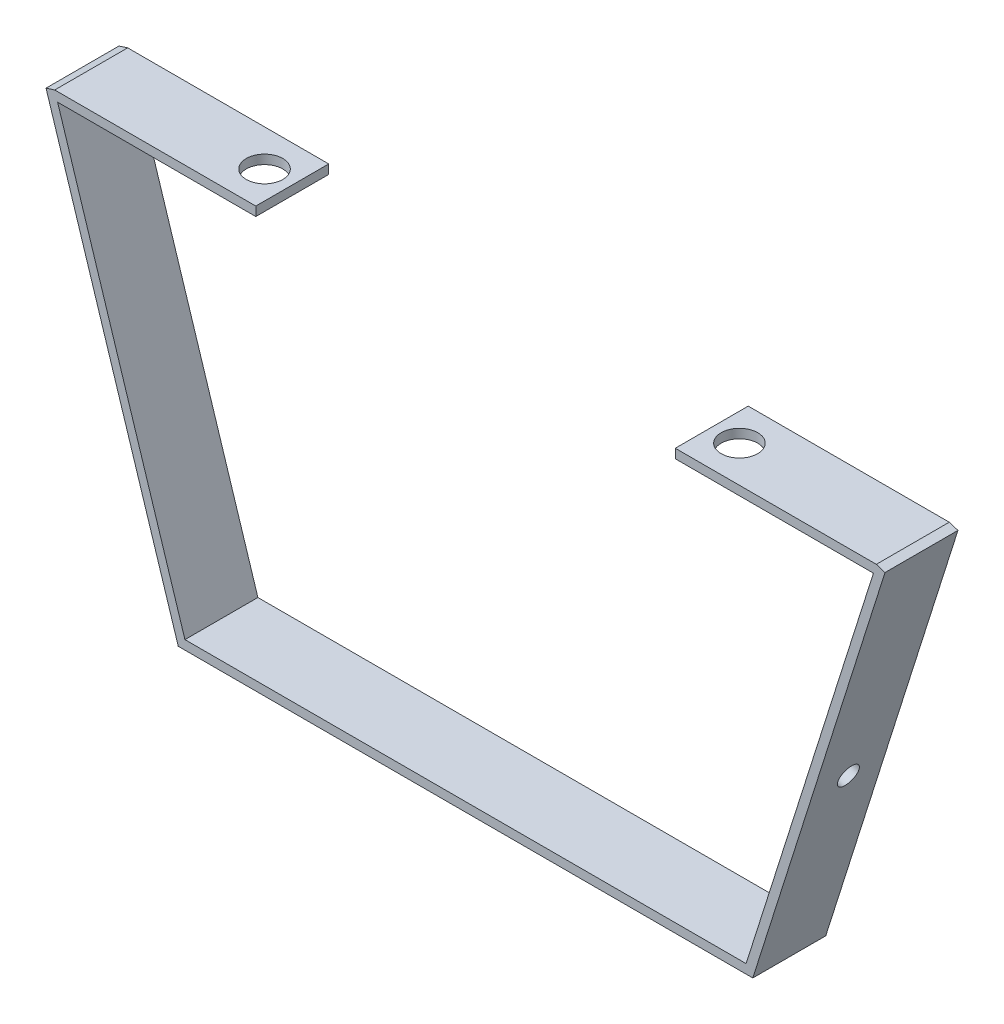
ISO-10303-21;
HEADER;
FILE_DESCRIPTION(('STEP AP214'),'2;1');
FILE_NAME('part.step','',(''),(''),'','','');
FILE_SCHEMA(('AUTOMOTIVE_DESIGN { 1 0 10303 214 1 1 1 1 }'));
ENDSEC;
DATA;
#1=APPLICATION_CONTEXT('core data for automotive mechanical design processes');
#2=APPLICATION_PROTOCOL_DEFINITION('international standard','automotive_design',2000,#1);
#3=PRODUCT_CONTEXT('',#1,'mechanical');
#4=PRODUCT('Part','Part','',(#3));
#5=PRODUCT_RELATED_PRODUCT_CATEGORY('part','',(#4));
#6=PRODUCT_DEFINITION_FORMATION('','',#4);
#7=PRODUCT_DEFINITION_CONTEXT('part definition',#1,'design');
#8=PRODUCT_DEFINITION('design','',#6,#7);
#9=PRODUCT_DEFINITION_SHAPE('','',#8);
#10=(LENGTH_UNIT() NAMED_UNIT(*) SI_UNIT(.MILLI.,.METRE.));
#11=(NAMED_UNIT(*) PLANE_ANGLE_UNIT() SI_UNIT($,.RADIAN.));
#12=(NAMED_UNIT(*) SI_UNIT($,.STERADIAN.) SOLID_ANGLE_UNIT());
#13=UNCERTAINTY_MEASURE_WITH_UNIT(LENGTH_MEASURE(1.E-05),#10,'distance_accuracy_value','');
#14=(GEOMETRIC_REPRESENTATION_CONTEXT(3) GLOBAL_UNCERTAINTY_ASSIGNED_CONTEXT((#13)) GLOBAL_UNIT_ASSIGNED_CONTEXT((#10,
#11,#12)) REPRESENTATION_CONTEXT('',''));
#15=CARTESIAN_POINT('',(0.,0.,0.));
#16=DIRECTION('',(0.,0.,1.));
#17=DIRECTION('',(1.,0.,0.));
#18=AXIS2_PLACEMENT_3D('',#15,#16,#17);
#19=CARTESIAN_POINT('',(-95.9147297448123,-24.4509063930494,25.4));
#20=DIRECTION('',(0.953281521756413,0.302083333333333,0.));
#21=DIRECTION('',(-0.302083333333333,0.953281521756413,0.));
#22=AXIS2_PLACEMENT_3D('',#19,#20,#21);
#23=PLANE('',#22);
#24=DIRECTION('',(0.302083333333333,-0.953281521756413,0.));
#25=VECTOR('',#24,1.);
#26=CARTESIAN_POINT('',(-95.9147297448123,-24.4509063930494,0.));
#27=LINE('',#26,#25);
#28=CARTESIAN_POINT('',(-141.952229744812,120.829197522628,0.));
#29=VERTEX_POINT('',#28);
#30=CARTESIAN_POINT('',(-95.9147297448123,-24.4509063930494,0.));
#31=VERTEX_POINT('',#30);
#32=EDGE_CURVE('E193',#29,#31,#27,.T.);
#33=ORIENTED_EDGE('',*,*,#32,.T.);
#34=DIRECTION('',(0.,0.,-1.));
#35=VECTOR('',#34,1.);
#36=CARTESIAN_POINT('',(-95.9147297448123,-24.4509063930494,25.4));
#37=LINE('',#36,#35);
#38=CARTESIAN_POINT('',(-95.9147297448123,-24.4509063930494,25.4));
#39=VERTEX_POINT('',#38);
#40=EDGE_CURVE('E11',#39,#31,#37,.T.);
#41=ORIENTED_EDGE('',*,*,#40,.F.);
#42=DIRECTION('',(0.302083333333333,-0.953281521756413,0.));
#43=VECTOR('',#42,1.);
#44=CARTESIAN_POINT('',(-95.9147297448123,-24.4509063930494,25.4));
#45=LINE('',#44,#43);
#46=CARTESIAN_POINT('',(-141.952229744812,120.829197522628,25.4));
#47=VERTEX_POINT('',#46);
#48=EDGE_CURVE('E199',#47,#39,#45,.T.);
#49=ORIENTED_EDGE('',*,*,#48,.F.);
#50=DIRECTION('',(0.,0.,-1.));
#51=VECTOR('',#50,1.);
#52=CARTESIAN_POINT('',(-141.952229744812,120.829197522628,25.4));
#53=LINE('',#52,#51);
#54=EDGE_CURVE('E216',#47,#29,#53,.T.);
#55=ORIENTED_EDGE('',*,*,#54,.T.);
#56=EDGE_LOOP('',(#33,#41,#49,#55));
#57=FACE_BOUND('',#56,.T.);
#58=ADVANCED_FACE('F36',(#57),#23,.F.);
#59=CARTESIAN_POINT('',(-95.9147297448123,-24.4509063930494,25.4));
#60=DIRECTION('',(0.,1.,0.));
#61=DIRECTION('',(-1.,0.,0.));
#62=AXIS2_PLACEMENT_3D('',#59,#60,#61);
#63=PLANE('',#62);
#64=DIRECTION('',(1.,0.,0.));
#65=VECTOR('',#64,1.);
#66=CARTESIAN_POINT('',(-95.9147297448123,-24.4509063930494,0.));
#67=LINE('',#66,#65);
#68=CARTESIAN_POINT('',(104.110270255188,-24.4509063930494,0.));
#69=VERTEX_POINT('',#68);
#70=EDGE_CURVE('E219',#31,#69,#67,.T.);
#71=ORIENTED_EDGE('',*,*,#70,.T.);
#72=DIRECTION('',(0.,0.,-1.));
#73=VECTOR('',#72,1.);
#74=CARTESIAN_POINT('',(104.110270255188,-24.4509063930494,25.4));
#75=LINE('',#74,#73);
#76=CARTESIAN_POINT('',(104.110270255188,-24.4509063930494,25.4));
#77=VERTEX_POINT('',#76);
#78=EDGE_CURVE('E44',#77,#69,#75,.T.);
#79=ORIENTED_EDGE('',*,*,#78,.F.);
#80=DIRECTION('',(1.,0.,0.));
#81=VECTOR('',#80,1.);
#82=CARTESIAN_POINT('',(-95.9147297448123,-24.4509063930494,25.4));
#83=LINE('',#82,#81);
#84=EDGE_CURVE('E201',#39,#77,#83,.T.);
#85=ORIENTED_EDGE('',*,*,#84,.F.);
#86=ORIENTED_EDGE('',*,*,#40,.T.);
#87=EDGE_LOOP('',(#71,#79,#85,#86));
#88=FACE_BOUND('',#87,.T.);
#89=ADVANCED_FACE('F272',(#88),#63,.F.);
#90=CARTESIAN_POINT('',(104.110270255188,-24.4509063930494,25.4));
#91=DIRECTION('',(-0.953281521756413,0.302083333333333,0.));
#92=DIRECTION('',(-0.302083333333333,-0.953281521756413,0.));
#93=AXIS2_PLACEMENT_3D('',#90,#91,#92);
#94=PLANE('',#93);
#95=CARTESIAN_POINT('',(124.695585575661,40.5099787309323,12.7));
#96=DIRECTION('',(0.953281521756413,-0.302083333333333,0.));
#97=DIRECTION('',(0.302083333333333,0.953281521756413,0.));
#98=AXIS2_PLACEMENT_3D('',#95,#96,#97);
#99=CIRCLE('',#98,3.675);
#100=CARTESIAN_POINT('',(125.805741825661,44.0132883233872,12.7));
#101=VERTEX_POINT('',#100);
#102=EDGE_CURVE('E419',#101,#101,#99,.T.);
#103=ORIENTED_EDGE('',*,*,#102,.F.);
#104=EDGE_LOOP('',(#103));
#105=FACE_BOUND('',#104,.T.);
#106=DIRECTION('',(0.302083333333333,0.953281521756413,0.));
#107=VECTOR('',#106,1.);
#108=CARTESIAN_POINT('',(104.110270255188,-24.4509063930494,0.));
#109=LINE('',#108,#107);
#110=CARTESIAN_POINT('',(150.147770255188,120.829197522628,0.));
#111=VERTEX_POINT('',#110);
#112=EDGE_CURVE('E221',#69,#111,#109,.T.);
#113=ORIENTED_EDGE('',*,*,#112,.T.);
#114=DIRECTION('',(0.,0.,-1.));
#115=VECTOR('',#114,1.);
#116=CARTESIAN_POINT('',(150.147770255188,120.829197522628,25.4));
#117=LINE('',#116,#115);
#118=CARTESIAN_POINT('',(150.147770255188,120.829197522628,25.4));
#119=VERTEX_POINT('',#118);
#120=EDGE_CURVE('E242',#119,#111,#117,.T.);
#121=ORIENTED_EDGE('',*,*,#120,.F.);
#122=DIRECTION('',(0.302083333333333,0.953281521756413,0.));
#123=VECTOR('',#122,1.);
#124=CARTESIAN_POINT('',(104.110270255188,-24.4509063930494,25.4));
#125=LINE('',#124,#123);
#126=EDGE_CURVE('E204',#77,#119,#125,.T.);
#127=ORIENTED_EDGE('',*,*,#126,.F.);
#128=ORIENTED_EDGE('',*,*,#78,.T.);
#129=EDGE_LOOP('',(#113,#121,#127,#128));
#130=FACE_BOUND('',#129,.T.);
#131=ADVANCED_FACE('F250',(#105,#130),#94,.F.);
#132=CARTESIAN_POINT('',(147.121101423611,121.788312105961,25.4));
#133=DIRECTION('',(-0.302083333333333,-0.953281521756413,0.));
#134=DIRECTION('',(0.953281521756413,-0.302083333333333,0.));
#135=AXIS2_PLACEMENT_3D('',#132,#133,#134);
#136=PLANE('',#135);
#137=DIRECTION('',(-0.953281521756413,0.302083333333333,0.));
#138=VECTOR('',#137,1.);
#139=CARTESIAN_POINT('',(147.121101423611,121.788312105961,0.));
#140=LINE('',#139,#138);
#141=CARTESIAN_POINT('',(147.121101423611,121.788312105961,0.));
#142=VERTEX_POINT('',#141);
#143=EDGE_CURVE('E223',#111,#142,#140,.T.);
#144=ORIENTED_EDGE('',*,*,#143,.T.);
#145=DIRECTION('',(0.,0.,-1.));
#146=VECTOR('',#145,1.);
#147=CARTESIAN_POINT('',(147.121101423611,121.788312105961,25.4));
#148=LINE('',#147,#146);
#149=CARTESIAN_POINT('',(147.121101423611,121.788312105961,25.4));
#150=VERTEX_POINT('',#149);
#151=EDGE_CURVE('E239',#150,#142,#148,.T.);
#152=ORIENTED_EDGE('',*,*,#151,.F.);
#153=DIRECTION('',(-0.953281521756413,0.302083333333333,0.));
#154=VECTOR('',#153,1.);
#155=CARTESIAN_POINT('',(147.121101423611,121.788312105961,25.4));
#156=LINE('',#155,#154);
#157=EDGE_CURVE('E206',#119,#150,#156,.T.);
#158=ORIENTED_EDGE('',*,*,#157,.F.);
#159=ORIENTED_EDGE('',*,*,#120,.T.);
#160=EDGE_LOOP('',(#144,#152,#158,#159));
#161=FACE_BOUND('',#160,.T.);
#162=ADVANCED_FACE('F261',(#161),#136,.F.);
#163=CARTESIAN_POINT('',(101.785788592537,-21.2759063930494,25.4));
#164=DIRECTION('',(0.953281521756413,-0.302083333333333,0.));
#165=DIRECTION('',(0.302083333333333,0.953281521756413,0.));
#166=AXIS2_PLACEMENT_3D('',#163,#164,#165);
#167=PLANE('',#166);
#168=CARTESIAN_POINT('',(121.668916744084,41.4690933142657,12.7));
#169=DIRECTION('',(0.953281521756413,-0.302083333333333,0.));
#170=DIRECTION('',(0.302083333333333,0.953281521756413,0.));
#171=AXIS2_PLACEMENT_3D('',#168,#169,#170);
#172=CIRCLE('',#171,3.675);
#173=CARTESIAN_POINT('',(122.779072994084,44.9724029067205,12.7));
#174=VERTEX_POINT('',#173);
#175=EDGE_CURVE('E416',#174,#174,#172,.T.);
#176=ORIENTED_EDGE('',*,*,#175,.T.);
#177=EDGE_LOOP('',(#176));
#178=FACE_BOUND('',#177,.T.);
#179=DIRECTION('',(-0.302083333333333,-0.953281521756413,0.));
#180=VECTOR('',#179,1.);
#181=CARTESIAN_POINT('',(101.785788592537,-21.2759063930494,25.4));
#182=LINE('',#181,#180);
#183=CARTESIAN_POINT('',(146.114982495001,118.613312105961,25.4));
#184=VERTEX_POINT('',#183);
#185=CARTESIAN_POINT('',(101.785788592537,-21.2759063930494,25.4));
#186=VERTEX_POINT('',#185);
#187=EDGE_CURVE('E208',#184,#186,#182,.T.);
#188=ORIENTED_EDGE('',*,*,#187,.F.);
#189=DIRECTION('',(0.,0.,-1.));
#190=VECTOR('',#189,1.);
#191=CARTESIAN_POINT('',(146.114982495001,118.613312105961,25.4));
#192=LINE('',#191,#190);
#193=CARTESIAN_POINT('',(146.114982495001,118.613312105961,0.));
#194=VERTEX_POINT('',#193);
#195=EDGE_CURVE('E194',#184,#194,#192,.T.);
#196=ORIENTED_EDGE('',*,*,#195,.T.);
#197=DIRECTION('',(-0.302083333333333,-0.953281521756413,0.));
#198=VECTOR('',#197,1.);
#199=CARTESIAN_POINT('',(101.785788592537,-21.2759063930494,0.));
#200=LINE('',#199,#198);
#201=CARTESIAN_POINT('',(101.785788592537,-21.2759063930494,0.));
#202=VERTEX_POINT('',#201);
#203=EDGE_CURVE('E225',#194,#202,#200,.T.);
#204=ORIENTED_EDGE('',*,*,#203,.T.);
#205=DIRECTION('',(0.,0.,-1.));
#206=VECTOR('',#205,1.);
#207=CARTESIAN_POINT('',(101.785788592537,-21.2759063930494,25.4));
#208=LINE('',#207,#206);
#209=EDGE_CURVE('E236',#186,#202,#208,.T.);
#210=ORIENTED_EDGE('',*,*,#209,.F.);
#211=EDGE_LOOP('',(#188,#196,#204,#210));
#212=FACE_BOUND('',#211,.T.);
#213=ADVANCED_FACE('F300',(#178,#212),#167,.F.);
#214=CARTESIAN_POINT('',(-93.5902480821614,-21.2759063930494,25.4));
#215=DIRECTION('',(0.,-1.,0.));
#216=DIRECTION('',(0.,0.,-1.));
#217=AXIS2_PLACEMENT_3D('',#214,#215,#216);
#218=PLANE('',#217);
#219=DIRECTION('',(-1.,0.,0.));
#220=VECTOR('',#219,1.);
#221=CARTESIAN_POINT('',(-93.5902480821614,-21.2759063930494,0.));
#222=LINE('',#221,#220);
#223=CARTESIAN_POINT('',(-93.5902480821614,-21.2759063930494,0.));
#224=VERTEX_POINT('',#223);
#225=EDGE_CURVE('E227',#202,#224,#222,.T.);
#226=ORIENTED_EDGE('',*,*,#225,.T.);
#227=DIRECTION('',(0.,0.,-1.));
#228=VECTOR('',#227,1.);
#229=CARTESIAN_POINT('',(-93.5902480821614,-21.2759063930494,25.4));
#230=LINE('',#229,#228);
#231=CARTESIAN_POINT('',(-93.5902480821614,-21.2759063930494,25.4));
#232=VERTEX_POINT('',#231);
#233=EDGE_CURVE('E234',#232,#224,#230,.T.);
#234=ORIENTED_EDGE('',*,*,#233,.F.);
#235=DIRECTION('',(-1.,0.,0.));
#236=VECTOR('',#235,1.);
#237=CARTESIAN_POINT('',(-93.5902480821614,-21.2759063930494,25.4));
#238=LINE('',#237,#236);
#239=EDGE_CURVE('E210',#186,#232,#238,.T.);
#240=ORIENTED_EDGE('',*,*,#239,.F.);
#241=ORIENTED_EDGE('',*,*,#209,.T.);
#242=EDGE_LOOP('',(#226,#234,#240,#241));
#243=FACE_BOUND('',#242,.T.);
#244=ADVANCED_FACE('F285',(#243),#218,.F.);
#245=CARTESIAN_POINT('',(-93.5902480821614,-21.2759063930494,25.4));
#246=DIRECTION('',(-0.953281521756413,-0.302083333333333,0.));
#247=DIRECTION('',(0.302083333333333,-0.953281521756413,0.));
#248=AXIS2_PLACEMENT_3D('',#245,#246,#247);
#249=PLANE('',#248);
#250=DIRECTION('',(-0.302083333333333,0.953281521756413,0.));
#251=VECTOR('',#250,1.);
#252=CARTESIAN_POINT('',(-93.5902480821614,-21.2759063930494,0.));
#253=LINE('',#252,#251);
#254=CARTESIAN_POINT('',(-137.919441984626,118.613312105961,0.));
#255=VERTEX_POINT('',#254);
#256=EDGE_CURVE('E56',#224,#255,#253,.T.);
#257=ORIENTED_EDGE('',*,*,#256,.T.);
#258=DIRECTION('',(0.,0.,-1.));
#259=VECTOR('',#258,1.);
#260=CARTESIAN_POINT('',(-137.919441984626,118.613312105961,25.4));
#261=LINE('',#260,#259);
#262=CARTESIAN_POINT('',(-137.919441984626,118.613312105961,25.4));
#263=VERTEX_POINT('',#262);
#264=EDGE_CURVE('E51',#263,#255,#261,.T.);
#265=ORIENTED_EDGE('',*,*,#264,.F.);
#266=DIRECTION('',(-0.302083333333333,0.953281521756413,0.));
#267=VECTOR('',#266,1.);
#268=CARTESIAN_POINT('',(-93.5902480821614,-21.2759063930494,25.4));
#269=LINE('',#268,#267);
#270=EDGE_CURVE('E212',#232,#263,#269,.T.);
#271=ORIENTED_EDGE('',*,*,#270,.F.);
#272=ORIENTED_EDGE('',*,*,#233,.T.);
#273=EDGE_LOOP('',(#257,#265,#271,#272));
#274=FACE_BOUND('',#273,.T.);
#275=ADVANCED_FACE('F278',(#274),#249,.F.);
#276=CARTESIAN_POINT('',(-141.952229744812,120.829197522628,25.4));
#277=DIRECTION('',(0.302083333333341,-0.95328152175641,0.));
#278=DIRECTION('',(0.95328152175641,0.302083333333341,0.));
#279=AXIS2_PLACEMENT_3D('',#276,#277,#278);
#280=PLANE('',#279);
#281=DIRECTION('',(-0.95328152175641,-0.302083333333341,0.));
#282=VECTOR('',#281,1.);
#283=CARTESIAN_POINT('',(-141.952229744812,120.829197522628,0.));
#284=LINE('',#283,#282);
#285=CARTESIAN_POINT('',(-138.925560913236,121.788312105961,0.));
#286=VERTEX_POINT('',#285);
#287=EDGE_CURVE('E202',#286,#29,#284,.T.);
#288=ORIENTED_EDGE('',*,*,#287,.T.);
#289=ORIENTED_EDGE('',*,*,#54,.F.);
#290=DIRECTION('',(-0.95328152175641,-0.302083333333341,0.));
#291=VECTOR('',#290,1.);
#292=CARTESIAN_POINT('',(-141.952229744812,120.829197522628,25.4));
#293=LINE('',#292,#291);
#294=CARTESIAN_POINT('',(-138.925560913236,121.788312105961,25.4));
#295=VERTEX_POINT('',#294);
#296=EDGE_CURVE('E214',#295,#47,#293,.T.);
#297=ORIENTED_EDGE('',*,*,#296,.F.);
#298=DIRECTION('',(0.,0.,-1.));
#299=VECTOR('',#298,1.);
#300=CARTESIAN_POINT('',(-138.925560913236,121.788312105961,25.4));
#301=LINE('',#300,#299);
#302=EDGE_CURVE('E155',#295,#286,#301,.T.);
#303=ORIENTED_EDGE('',*,*,#302,.T.);
#304=EDGE_LOOP('',(#288,#289,#297,#303));
#305=FACE_BOUND('',#304,.T.);
#306=ADVANCED_FACE('F276',(#305),#280,.F.);
#307=CARTESIAN_POINT('',(0.,0.,25.4));
#308=DIRECTION('',(0.,0.,-1.));
#309=DIRECTION('',(-1.,0.,0.));
#310=AXIS2_PLACEMENT_3D('',#307,#308,#309);
#311=PLANE('',#310);
#312=ORIENTED_EDGE('',*,*,#48,.T.);
#313=ORIENTED_EDGE('',*,*,#84,.T.);
#314=ORIENTED_EDGE('',*,*,#126,.T.);
#315=ORIENTED_EDGE('',*,*,#157,.T.);
#316=DIRECTION('',(-1.,0.,0.));
#317=VECTOR('',#316,1.);
#318=CARTESIAN_POINT('',(0.,121.788312105961,25.4));
#319=LINE('',#318,#317);
#320=CARTESIAN_POINT('',(77.1211014236111,121.788312105961,25.4));
#321=VERTEX_POINT('',#320);
#322=EDGE_CURVE('E178',#150,#321,#319,.T.);
#323=ORIENTED_EDGE('',*,*,#322,.T.);
#324=DIRECTION('',(0.,-1.,0.));
#325=VECTOR('',#324,1.);
#326=CARTESIAN_POINT('',(77.1211014236111,0.,25.4));
#327=LINE('',#326,#325);
#328=CARTESIAN_POINT('',(77.1211014236111,118.613312105961,25.4));
#329=VERTEX_POINT('',#328);
#330=EDGE_CURVE('E176',#321,#329,#327,.T.);
#331=ORIENTED_EDGE('',*,*,#330,.T.);
#332=DIRECTION('',(-1.,0.,0.));
#333=VECTOR('',#332,1.);
#334=CARTESIAN_POINT('',(0.,118.613312105961,25.4));
#335=LINE('',#334,#333);
#336=EDGE_CURVE('E181',#184,#329,#335,.T.);
#337=ORIENTED_EDGE('',*,*,#336,.F.);
#338=ORIENTED_EDGE('',*,*,#187,.T.);
#339=ORIENTED_EDGE('',*,*,#239,.T.);
#340=ORIENTED_EDGE('',*,*,#270,.T.);
#341=DIRECTION('',(-1.,0.,0.));
#342=VECTOR('',#341,1.);
#343=CARTESIAN_POINT('',(0.,118.613312105961,25.4));
#344=LINE('',#343,#342);
#345=CARTESIAN_POINT('',(-68.9255609132356,118.613312105961,25.4));
#346=VERTEX_POINT('',#345);
#347=EDGE_CURVE('E148',#346,#263,#344,.T.);
#348=ORIENTED_EDGE('',*,*,#347,.F.);
#349=DIRECTION('',(0.,-1.,0.));
#350=VECTOR('',#349,1.);
#351=CARTESIAN_POINT('',(-68.9255609132356,0.,25.4));
#352=LINE('',#351,#350);
#353=CARTESIAN_POINT('',(-68.9255609132356,121.788312105961,25.4));
#354=VERTEX_POINT('',#353);
#355=EDGE_CURVE('E141',#354,#346,#352,.T.);
#356=ORIENTED_EDGE('',*,*,#355,.F.);
#357=DIRECTION('',(-1.,0.,0.));
#358=VECTOR('',#357,1.);
#359=CARTESIAN_POINT('',(0.,121.788312105961,25.4));
#360=LINE('',#359,#358);
#361=EDGE_CURVE('E152',#354,#295,#360,.T.);
#362=ORIENTED_EDGE('',*,*,#361,.T.);
#363=ORIENTED_EDGE('',*,*,#296,.T.);
#364=EDGE_LOOP('',(#312,#313,#314,#315,#323,#331,#337,#338,#339,#340,#348,#356,#362,#363));
#365=FACE_BOUND('',#364,.T.);
#366=ADVANCED_FACE('F161',(#365),#311,.F.);
#367=CARTESIAN_POINT('',(0.,0.,0.));
#368=DIRECTION('',(0.,0.,-1.));
#369=DIRECTION('',(-1.,0.,0.));
#370=AXIS2_PLACEMENT_3D('',#367,#368,#369);
#371=PLANE('',#370);
#372=ORIENTED_EDGE('',*,*,#32,.F.);
#373=ORIENTED_EDGE('',*,*,#287,.F.);
#374=DIRECTION('',(-1.,0.,0.));
#375=VECTOR('',#374,1.);
#376=CARTESIAN_POINT('',(0.,121.788312105961,0.));
#377=LINE('',#376,#375);
#378=CARTESIAN_POINT('',(-68.9255609132356,121.788312105961,0.));
#379=VERTEX_POINT('',#378);
#380=EDGE_CURVE('E167',#379,#286,#377,.T.);
#381=ORIENTED_EDGE('',*,*,#380,.F.);
#382=DIRECTION('',(0.,-1.,0.));
#383=VECTOR('',#382,1.);
#384=CARTESIAN_POINT('',(-68.9255609132356,0.,0.));
#385=LINE('',#384,#383);
#386=CARTESIAN_POINT('',(-68.9255609132356,118.613312105961,0.));
#387=VERTEX_POINT('',#386);
#388=EDGE_CURVE('E143',#379,#387,#385,.T.);
#389=ORIENTED_EDGE('',*,*,#388,.T.);
#390=DIRECTION('',(-1.,0.,0.));
#391=VECTOR('',#390,1.);
#392=CARTESIAN_POINT('',(0.,118.613312105961,0.));
#393=LINE('',#392,#391);
#394=EDGE_CURVE('E157',#387,#255,#393,.T.);
#395=ORIENTED_EDGE('',*,*,#394,.T.);
#396=ORIENTED_EDGE('',*,*,#256,.F.);
#397=ORIENTED_EDGE('',*,*,#225,.F.);
#398=ORIENTED_EDGE('',*,*,#203,.F.);
#399=DIRECTION('',(-1.,0.,0.));
#400=VECTOR('',#399,1.);
#401=CARTESIAN_POINT('',(0.,118.613312105961,0.));
#402=LINE('',#401,#400);
#403=CARTESIAN_POINT('',(77.1211014236111,118.613312105961,0.));
#404=VERTEX_POINT('',#403);
#405=EDGE_CURVE('E179',#194,#404,#402,.T.);
#406=ORIENTED_EDGE('',*,*,#405,.T.);
#407=DIRECTION('',(0.,-1.,0.));
#408=VECTOR('',#407,1.);
#409=CARTESIAN_POINT('',(77.1211014236111,0.,0.));
#410=LINE('',#409,#408);
#411=CARTESIAN_POINT('',(77.1211014236111,121.788312105961,0.));
#412=VERTEX_POINT('',#411);
#413=EDGE_CURVE('E174',#412,#404,#410,.T.);
#414=ORIENTED_EDGE('',*,*,#413,.F.);
#415=DIRECTION('',(-1.,0.,0.));
#416=VECTOR('',#415,1.);
#417=CARTESIAN_POINT('',(0.,121.788312105961,0.));
#418=LINE('',#417,#416);
#419=EDGE_CURVE('E187',#142,#412,#418,.T.);
#420=ORIENTED_EDGE('',*,*,#419,.F.);
#421=ORIENTED_EDGE('',*,*,#143,.F.);
#422=ORIENTED_EDGE('',*,*,#112,.F.);
#423=ORIENTED_EDGE('',*,*,#70,.F.);
#424=EDGE_LOOP('',(#372,#373,#381,#389,#395,#396,#397,#398,#406,#414,#420,#421,#422,#423));
#425=FACE_BOUND('',#424,.T.);
#426=ADVANCED_FACE('F256',(#425),#371,.T.);
#427=CARTESIAN_POINT('',(77.1211014236111,0.,25.4));
#428=DIRECTION('',(1.,0.,0.));
#429=DIRECTION('',(0.,0.,-1.));
#430=AXIS2_PLACEMENT_3D('',#427,#428,#429);
#431=PLANE('',#430);
#432=ORIENTED_EDGE('',*,*,#413,.T.);
#433=DIRECTION('',(0.,0.,-1.));
#434=VECTOR('',#433,1.);
#435=CARTESIAN_POINT('',(77.1211014236111,118.613312105961,25.4));
#436=LINE('',#435,#434);
#437=EDGE_CURVE('E191',#329,#404,#436,.T.);
#438=ORIENTED_EDGE('',*,*,#437,.F.);
#439=ORIENTED_EDGE('',*,*,#330,.F.);
#440=DIRECTION('',(0.,0.,-1.));
#441=VECTOR('',#440,1.);
#442=CARTESIAN_POINT('',(77.1211014236111,121.788312105961,25.4));
#443=LINE('',#442,#441);
#444=EDGE_CURVE('E184',#321,#412,#443,.T.);
#445=ORIENTED_EDGE('',*,*,#444,.T.);
#446=EDGE_LOOP('',(#432,#438,#439,#445));
#447=FACE_BOUND('',#446,.T.);
#448=ADVANCED_FACE('F333',(#447),#431,.F.);
#449=CARTESIAN_POINT('',(0.,118.613312105961,25.4));
#450=DIRECTION('',(0.,-1.,0.));
#451=DIRECTION('',(0.,0.,-1.));
#452=AXIS2_PLACEMENT_3D('',#449,#450,#451);
#453=PLANE('',#452);
#454=CARTESIAN_POINT('',(86.7711014236111,118.613312105961,12.7));
#455=DIRECTION('',(0.,-1.,0.));
#456=DIRECTION('',(0.,0.,-1.));
#457=AXIS2_PLACEMENT_3D('',#454,#455,#456);
#458=CIRCLE('',#457,6.35);
#459=CARTESIAN_POINT('',(86.7711014236111,118.613312105961,6.35));
#460=VERTEX_POINT('',#459);
#461=EDGE_CURVE('E169',#460,#460,#458,.T.);
#462=ORIENTED_EDGE('',*,*,#461,.F.);
#463=EDGE_LOOP('',(#462));
#464=FACE_BOUND('',#463,.T.);
#465=ORIENTED_EDGE('',*,*,#405,.F.);
#466=ORIENTED_EDGE('',*,*,#195,.F.);
#467=ORIENTED_EDGE('',*,*,#336,.T.);
#468=ORIENTED_EDGE('',*,*,#437,.T.);
#469=EDGE_LOOP('',(#465,#466,#467,#468));
#470=FACE_BOUND('',#469,.T.);
#471=ADVANCED_FACE('F330',(#464,#470),#453,.T.);
#472=CARTESIAN_POINT('',(0.,121.788312105961,25.4));
#473=DIRECTION('',(0.,-1.,0.));
#474=DIRECTION('',(1.,0.,0.));
#475=AXIS2_PLACEMENT_3D('',#472,#473,#474);
#476=PLANE('',#475);
#477=CARTESIAN_POINT('',(86.7711014236111,121.788312105961,12.7));
#478=DIRECTION('',(0.,1.,0.));
#479=DIRECTION('',(-1.,0.,0.));
#480=AXIS2_PLACEMENT_3D('',#477,#478,#479);
#481=CIRCLE('',#480,6.35);
#482=CARTESIAN_POINT('',(80.4211014236111,121.788312105961,12.7));
#483=VERTEX_POINT('',#482);
#484=EDGE_CURVE('E424',#483,#483,#481,.T.);
#485=ORIENTED_EDGE('',*,*,#484,.F.);
#486=EDGE_LOOP('',(#485));
#487=FACE_BOUND('',#486,.T.);
#488=ORIENTED_EDGE('',*,*,#419,.T.);
#489=ORIENTED_EDGE('',*,*,#444,.F.);
#490=ORIENTED_EDGE('',*,*,#322,.F.);
#491=ORIENTED_EDGE('',*,*,#151,.T.);
#492=EDGE_LOOP('',(#488,#489,#490,#491));
#493=FACE_BOUND('',#492,.T.);
#494=ADVANCED_FACE('F265',(#487,#493),#476,.F.);
#495=CARTESIAN_POINT('',(0.,121.788312105961,25.4));
#496=DIRECTION('',(0.,-1.,0.));
#497=DIRECTION('',(1.,0.,0.));
#498=AXIS2_PLACEMENT_3D('',#495,#496,#497);
#499=PLANE('',#498);
#500=CARTESIAN_POINT('',(-78.5755609132356,121.788312105961,12.7));
#501=DIRECTION('',(0.,1.,0.));
#502=DIRECTION('',(-1.,0.,0.));
#503=AXIS2_PLACEMENT_3D('',#500,#501,#502);
#504=CIRCLE('',#503,6.35);
#505=CARTESIAN_POINT('',(-84.9255609132356,121.788312105961,12.7));
#506=VERTEX_POINT('',#505);
#507=EDGE_CURVE('E421',#506,#506,#504,.T.);
#508=ORIENTED_EDGE('',*,*,#507,.F.);
#509=EDGE_LOOP('',(#508));
#510=FACE_BOUND('',#509,.T.);
#511=ORIENTED_EDGE('',*,*,#380,.T.);
#512=ORIENTED_EDGE('',*,*,#302,.F.);
#513=ORIENTED_EDGE('',*,*,#361,.F.);
#514=DIRECTION('',(0.,0.,-1.));
#515=VECTOR('',#514,1.);
#516=CARTESIAN_POINT('',(-68.9255609132356,121.788312105961,25.4));
#517=LINE('',#516,#515);
#518=EDGE_CURVE('E137',#354,#379,#517,.T.);
#519=ORIENTED_EDGE('',*,*,#518,.T.);
#520=EDGE_LOOP('',(#511,#512,#513,#519));
#521=FACE_BOUND('',#520,.T.);
#522=ADVANCED_FACE('F153',(#510,#521),#499,.F.);
#523=CARTESIAN_POINT('',(0.,118.613312105961,25.4));
#524=DIRECTION('',(0.,-1.,0.));
#525=DIRECTION('',(0.,0.,-1.));
#526=AXIS2_PLACEMENT_3D('',#523,#524,#525);
#527=PLANE('',#526);
#528=CARTESIAN_POINT('',(-78.5755609132356,118.613312105961,12.7));
#529=DIRECTION('',(0.,-1.,0.));
#530=DIRECTION('',(0.,0.,-1.));
#531=AXIS2_PLACEMENT_3D('',#528,#529,#530);
#532=CIRCLE('',#531,6.35);
#533=CARTESIAN_POINT('',(-78.5755609132356,118.613312105961,6.35));
#534=VERTEX_POINT('',#533);
#535=EDGE_CURVE('E39',#534,#534,#532,.T.);
#536=ORIENTED_EDGE('',*,*,#535,.F.);
#537=EDGE_LOOP('',(#536));
#538=FACE_BOUND('',#537,.T.);
#539=ORIENTED_EDGE('',*,*,#394,.F.);
#540=DIRECTION('',(0.,0.,-1.));
#541=VECTOR('',#540,1.);
#542=CARTESIAN_POINT('',(-68.9255609132356,118.613312105961,25.4));
#543=LINE('',#542,#541);
#544=EDGE_CURVE('E147',#346,#387,#543,.T.);
#545=ORIENTED_EDGE('',*,*,#544,.F.);
#546=ORIENTED_EDGE('',*,*,#347,.T.);
#547=ORIENTED_EDGE('',*,*,#264,.T.);
#548=EDGE_LOOP('',(#539,#545,#546,#547));
#549=FACE_BOUND('',#548,.T.);
#550=ADVANCED_FACE('F314',(#538,#549),#527,.T.);
#551=CARTESIAN_POINT('',(-68.9255609132356,0.,25.4));
#552=DIRECTION('',(1.,0.,0.));
#553=DIRECTION('',(0.,0.,-1.));
#554=AXIS2_PLACEMENT_3D('',#551,#552,#553);
#555=PLANE('',#554);
#556=ORIENTED_EDGE('',*,*,#388,.F.);
#557=ORIENTED_EDGE('',*,*,#518,.F.);
#558=ORIENTED_EDGE('',*,*,#355,.T.);
#559=ORIENTED_EDGE('',*,*,#544,.T.);
#560=EDGE_LOOP('',(#556,#557,#558,#559));
#561=FACE_BOUND('',#560,.T.);
#562=ADVANCED_FACE('F139',(#561),#555,.T.);
#563=CARTESIAN_POINT('',(-78.5755609132356,111.788312105961,12.7));
#564=DIRECTION('',(0.,1.,0.));
#565=DIRECTION('',(-1.,0.,0.));
#566=AXIS2_PLACEMENT_3D('',#563,#564,#565);
#567=CYLINDRICAL_SURFACE('',#566,6.35);
#568=ORIENTED_EDGE('',*,*,#535,.T.);
#569=EDGE_LOOP('',(#568));
#570=FACE_BOUND('',#569,.T.);
#571=ORIENTED_EDGE('',*,*,#507,.T.);
#572=EDGE_LOOP('',(#571));
#573=FACE_BOUND('',#572,.T.);
#574=ADVANCED_FACE('F322',(#570,#573),#567,.F.);
#575=CARTESIAN_POINT('',(86.7711014236111,111.788312105961,12.7));
#576=DIRECTION('',(0.,1.,0.));
#577=DIRECTION('',(-1.,0.,0.));
#578=AXIS2_PLACEMENT_3D('',#575,#576,#577);
#579=CYLINDRICAL_SURFACE('',#578,6.35);
#580=ORIENTED_EDGE('',*,*,#461,.T.);
#581=EDGE_LOOP('',(#580));
#582=FACE_BOUND('',#581,.T.);
#583=ORIENTED_EDGE('',*,*,#484,.T.);
#584=EDGE_LOOP('',(#583));
#585=FACE_BOUND('',#584,.T.);
#586=ADVANCED_FACE('F376',(#582,#585),#579,.F.);
#587=CARTESIAN_POINT('',(121.668916744084,41.4690933142657,12.7));
#588=DIRECTION('',(0.953281521756413,-0.302083333333333,0.));
#589=DIRECTION('',(0.302083333333333,0.953281521756413,0.));
#590=AXIS2_PLACEMENT_3D('',#587,#588,#589);
#591=CYLINDRICAL_SURFACE('',#590,3.675);
#592=ORIENTED_EDGE('',*,*,#175,.F.);
#593=EDGE_LOOP('',(#592));
#594=FACE_BOUND('',#593,.T.);
#595=ORIENTED_EDGE('',*,*,#102,.T.);
#596=EDGE_LOOP('',(#595));
#597=FACE_BOUND('',#596,.T.);
#598=ADVANCED_FACE('F385',(#594,#597),#591,.F.);
#599=CLOSED_SHELL('',(#58,#89,#131,#162,#213,#244,#275,#306,#366,#426,#448,#471,#494,#522,#550,
#562,#574,#586,#598));
#600=MANIFOLD_SOLID_BREP('B2',#599);
#601=ADVANCED_BREP_SHAPE_REPRESENTATION('',(#18,#600),#14);
#602=SHAPE_DEFINITION_REPRESENTATION(#9,#601);
ENDSEC;
END-ISO-10303-21;
